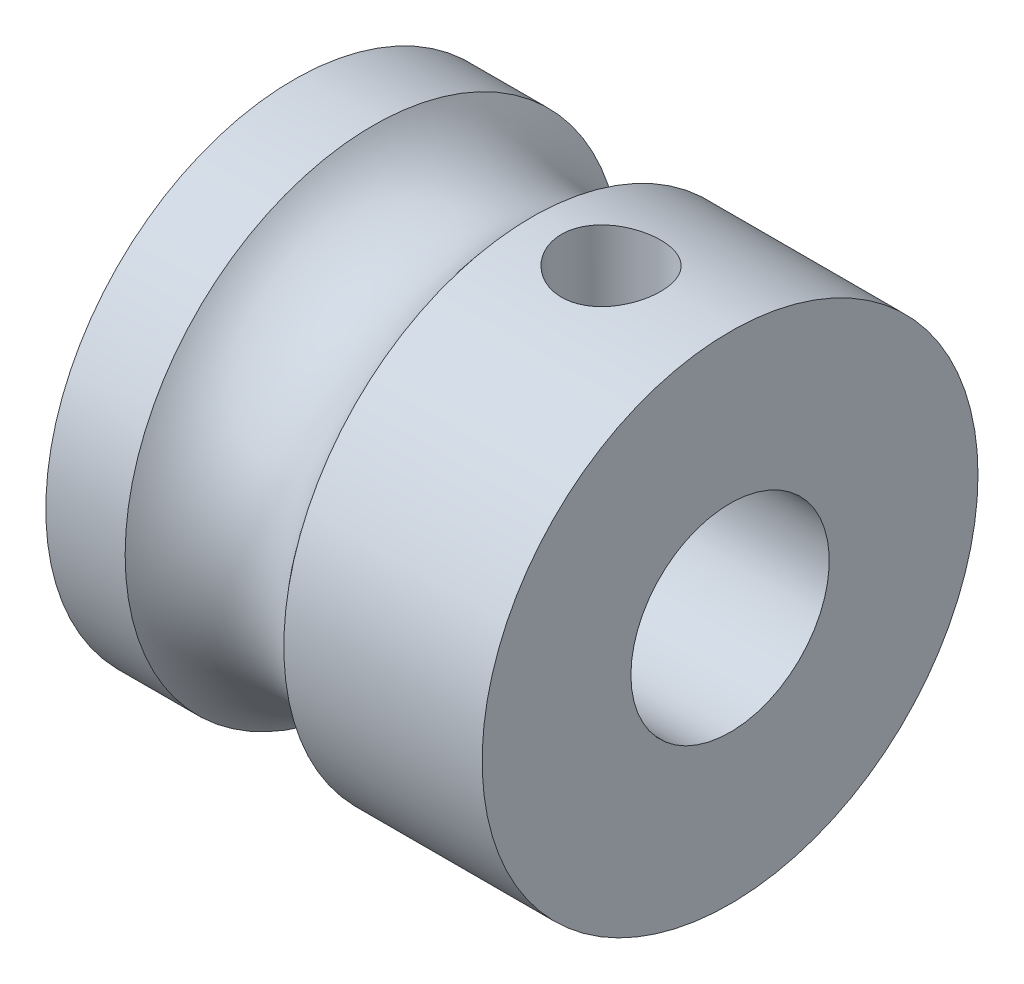
ISO-10303-21;
HEADER;
FILE_DESCRIPTION(('STEP AP214'),'2;1');
FILE_NAME('part.step','',(''),(''),'','','');
FILE_SCHEMA(('AUTOMOTIVE_DESIGN { 1 0 10303 214 1 1 1 1 }'));
ENDSEC;
DATA;
#1=APPLICATION_CONTEXT('core data for automotive mechanical design processes');
#2=APPLICATION_PROTOCOL_DEFINITION('international standard','automotive_design',2000,#1);
#3=PRODUCT_CONTEXT('',#1,'mechanical');
#4=PRODUCT('Part','Part','',(#3));
#5=PRODUCT_RELATED_PRODUCT_CATEGORY('part','',(#4));
#6=PRODUCT_DEFINITION_FORMATION('','',#4);
#7=PRODUCT_DEFINITION_CONTEXT('part definition',#1,'design');
#8=PRODUCT_DEFINITION('design','',#6,#7);
#9=PRODUCT_DEFINITION_SHAPE('','',#8);
#10=(LENGTH_UNIT() NAMED_UNIT(*) SI_UNIT(.MILLI.,.METRE.));
#11=(NAMED_UNIT(*) PLANE_ANGLE_UNIT() SI_UNIT($,.RADIAN.));
#12=(NAMED_UNIT(*) SI_UNIT($,.STERADIAN.) SOLID_ANGLE_UNIT());
#13=UNCERTAINTY_MEASURE_WITH_UNIT(LENGTH_MEASURE(1.E-05),#10,'distance_accuracy_value','');
#14=(GEOMETRIC_REPRESENTATION_CONTEXT(3) GLOBAL_UNCERTAINTY_ASSIGNED_CONTEXT((#13)) GLOBAL_UNIT_ASSIGNED_CONTEXT((#10,
#11,#12)) REPRESENTATION_CONTEXT('',''));
#15=CARTESIAN_POINT('',(0.,0.,0.));
#16=DIRECTION('',(0.,0.,1.));
#17=DIRECTION('',(1.,0.,0.));
#18=AXIS2_PLACEMENT_3D('',#15,#16,#17);
#19=CARTESIAN_POINT('',(-4.2166088223,-11.0652643177,178.13));
#20=DIRECTION('',(-1.,0.,0.));
#21=DIRECTION('',(0.,0.,1.));
#22=AXIS2_PLACEMENT_3D('',#19,#20,#21);
#23=PLANE('',#22);
#24=CARTESIAN_POINT('',(-4.2166088223,-11.0652643177,178.13));
#25=DIRECTION('',(1.,0.,0.));
#26=DIRECTION('',(0.,0.,-1.));
#27=AXIS2_PLACEMENT_3D('',#24,#25,#26);
#28=CIRCLE('',#27,6.25);
#29=CARTESIAN_POINT('',(-4.2166088223,-11.0652643177,171.88));
#30=VERTEX_POINT('',#29);
#31=EDGE_CURVE('E17',#30,#30,#28,.T.);
#32=ORIENTED_EDGE('',*,*,#31,.F.);
#33=EDGE_LOOP('',(#32));
#34=FACE_BOUND('',#33,.T.);
#35=CARTESIAN_POINT('',(-4.2166088223,-11.0652643177,178.13));
#36=DIRECTION('',(-1.,0.,0.));
#37=DIRECTION('',(0.,0.,1.));
#38=AXIS2_PLACEMENT_3D('',#35,#36,#37);
#39=CIRCLE('',#38,2.5);
#40=CARTESIAN_POINT('',(-4.2166088223,-11.0652643177,180.63));
#41=VERTEX_POINT('',#40);
#42=EDGE_CURVE('E82',#41,#41,#39,.F.);
#43=ORIENTED_EDGE('',*,*,#42,.T.);
#44=EDGE_LOOP('',(#43));
#45=FACE_BOUND('',#44,.T.);
#46=ADVANCED_FACE('F14',(#34,#45),#23,.T.);
#47=CARTESIAN_POINT('',(-4.2166088223,-11.0652643177,178.13));
#48=DIRECTION('',(1.,0.,0.));
#49=DIRECTION('',(0.,0.,-1.));
#50=AXIS2_PLACEMENT_3D('',#47,#48,#49);
#51=CYLINDRICAL_SURFACE('',#50,6.25);
#52=CARTESIAN_POINT('',(-2.2166088223,-11.0652643177,178.13));
#53=DIRECTION('',(1.,0.,0.));
#54=DIRECTION('',(0.,0.,1.));
#55=AXIS2_PLACEMENT_3D('',#52,#53,#54);
#56=CIRCLE('',#55,6.24999999999998);
#57=CARTESIAN_POINT('',(-2.2166088223,-11.0652643177,184.38));
#58=VERTEX_POINT('',#57);
#59=EDGE_CURVE('E34',#58,#58,#56,.T.);
#60=ORIENTED_EDGE('',*,*,#59,.F.);
#61=EDGE_LOOP('',(#60));
#62=FACE_BOUND('',#61,.T.);
#63=ORIENTED_EDGE('',*,*,#31,.T.);
#64=EDGE_LOOP('',(#63));
#65=FACE_BOUND('',#64,.T.);
#66=ADVANCED_FACE('F70',(#62,#65),#51,.T.);
#67=CARTESIAN_POINT('',(6.7833911777,-11.0652643177,178.13));
#68=DIRECTION('',(-1.,0.,0.));
#69=DIRECTION('',(0.,0.,1.));
#70=AXIS2_PLACEMENT_3D('',#67,#68,#69);
#71=CYLINDRICAL_SURFACE('',#70,2.5);
#72=CARTESIAN_POINT('',(6.7833911777,-11.0652643177,178.13));
#73=DIRECTION('',(-1.,0.,0.));
#74=DIRECTION('',(0.,0.,1.));
#75=AXIS2_PLACEMENT_3D('',#72,#73,#74);
#76=CIRCLE('',#75,2.5);
#77=CARTESIAN_POINT('',(6.7833911777,-11.0652643177,180.63));
#78=VERTEX_POINT('',#77);
#79=EDGE_CURVE('E60',#78,#78,#76,.F.);
#80=ORIENTED_EDGE('',*,*,#79,.T.);
#81=EDGE_LOOP('',(#80));
#82=FACE_BOUND('',#81,.T.);
#83=CARTESIAN_POINT('',(3.7833911777,-8.9002008082389,176.88));
#84=CARTESIAN_POINT('',(3.71825641745594,-8.90019513359426,176.880004546157));
#85=CARTESIAN_POINT('',(3.65303941329369,-8.89721680285304,176.885125036584));
#86=CARTESIAN_POINT('',(3.52460709685356,-8.88573473704934,176.905345987627));
#87=CARTESIAN_POINT('',(3.46139628389574,-8.87721939200551,176.920467419307));
#88=CARTESIAN_POINT('',(3.33907659727008,-8.85589748513252,176.959875064125));
#89=CARTESIAN_POINT('',(3.27994786210802,-8.84311377428435,176.984112559383));
#90=CARTESIAN_POINT('',(3.16661092520411,-8.81473100748928,177.04091559328));
#91=CARTESIAN_POINT('',(3.11240298987194,-8.79913179924919,177.073481582455));
#92=CARTESIAN_POINT('',(3.00550901700313,-8.76530345448199,177.149166824336));
#93=CARTESIAN_POINT('',(2.95331725810808,-8.74696352222558,177.19293495482));
#94=CARTESIAN_POINT('',(2.85663069219162,-8.71061453287868,177.288432740482));
#95=CARTESIAN_POINT('',(2.8121397244706,-8.69260564480938,177.340166342772));
#96=CARTESIAN_POINT('',(2.72918223876542,-8.65749585578814,177.454388045732));
#97=CARTESIAN_POINT('',(2.69132396787559,-8.64053798747285,177.517366013734));
#98=CARTESIAN_POINT('',(2.6269651111428,-8.61087986645589,177.649803716751));
#99=CARTESIAN_POINT('',(2.60045735752854,-8.59817692790323,177.719259327327));
#100=CARTESIAN_POINT('',(2.56151035107363,-8.57925855214703,177.857443820093));
#101=CARTESIAN_POINT('',(2.54820426975558,-8.57264581493885,177.925872761889));
#102=CARTESIAN_POINT('',(2.5331835293562,-8.56516951962416,178.064286714128));
#103=CARTESIAN_POINT('',(2.53146185670536,-8.56430248289263,178.134270757305));
#104=CARTESIAN_POINT('',(2.53932452016294,-8.56822704374437,178.26729065553));
#105=CARTESIAN_POINT('',(2.54793869710153,-8.572533119048,178.330401498971));
#106=CARTESIAN_POINT('',(2.57449223258082,-8.58558625195316,178.454142214898));
#107=CARTESIAN_POINT('',(2.59243228892028,-8.59433364187008,178.514771901367));
#108=CARTESIAN_POINT('',(2.63724438531227,-8.61561952660432,178.632886739462));
#109=CARTESIAN_POINT('',(2.66423656916509,-8.62820879858501,178.690316779394));
#110=CARTESIAN_POINT('',(2.72622044795187,-8.65604374286641,178.799971001892));
#111=CARTESIAN_POINT('',(2.76121500682794,-8.67129036573145,178.852193311048));
#112=CARTESIAN_POINT('',(2.84201036711627,-8.70470938770964,178.955217076123));
#113=CARTESIAN_POINT('',(2.88851996310752,-8.72302211772281,179.005417593787));
#114=CARTESIAN_POINT('',(2.98912833386273,-8.75958506036486,179.097630462872));
#115=CARTESIAN_POINT('',(3.04323289304259,-8.77783521437964,179.139636514468));
#116=CARTESIAN_POINT('',(3.16170141823012,-8.81346236654395,179.216881668303));
#117=CARTESIAN_POINT('',(3.22649870651778,-8.83071031781616,179.251521643723));
#118=CARTESIAN_POINT('',(3.36206326689876,-8.86057118921781,179.309148891252));
#119=CARTESIAN_POINT('',(3.43282421897196,-8.87318894212416,179.332148322764));
#120=CARTESIAN_POINT('',(3.57240931680349,-8.89095636998707,179.363975263781));
#121=CARTESIAN_POINT('',(3.64094257650444,-8.8966186195938,179.37378140265));
#122=CARTESIAN_POINT('',(3.77889285459567,-8.90129032567988,179.381896183264));
#123=CARTESIAN_POINT('',(3.84830921409973,-8.90030448158361,179.380212946644));
#124=CARTESIAN_POINT('',(3.97795857592341,-8.89233511094269,179.36629505418));
#125=CARTESIAN_POINT('',(4.03836549158491,-8.88601947386682,179.355234770891));
#126=CARTESIAN_POINT('',(4.1563509105387,-8.86908904830824,179.324620355791));
#127=CARTESIAN_POINT('',(4.21392849113326,-8.85847286763708,179.30506347328));
#128=CARTESIAN_POINT('',(4.32765534132836,-8.8335615417043,179.257059485756));
#129=CARTESIAN_POINT('',(4.38361494876693,-8.81911877716171,179.228242579616));
#130=CARTESIAN_POINT('',(4.49022776712374,-8.78831282398438,179.16285883002));
#131=CARTESIAN_POINT('',(4.54087823209161,-8.77194865076065,179.126288005415));
#132=CARTESIAN_POINT('',(4.64211463710444,-8.7366643369958,179.041046458999));
#133=CARTESIAN_POINT('',(4.69188761609708,-8.71768202827139,178.991431590394));
#134=CARTESIAN_POINT('',(4.78265647519199,-8.68108638047635,178.884255619248));
#135=CARTESIAN_POINT('',(4.82364939048817,-8.66347350510364,178.826691843319));
#136=CARTESIAN_POINT('',(4.89660833513762,-8.63099729656304,178.703169203198));
#137=CARTESIAN_POINT('',(4.92830757546363,-8.61621879679964,178.637028871968));
#138=CARTESIAN_POINT('',(4.97981355752174,-8.59172238070874,178.499402955801));
#139=CARTESIAN_POINT('',(4.99963074190788,-8.58200002174534,178.42792212674));
#140=CARTESIAN_POINT('',(5.02510188291832,-8.56942046542647,178.288724602913));
#141=CARTESIAN_POINT('',(5.03188852254514,-8.56601521884761,178.221264304813));
#142=CARTESIAN_POINT('',(5.034445259518,-8.56473768801086,178.086092517561));
#143=CARTESIAN_POINT('',(5.03021921335446,-8.56686346686388,178.018381124631));
#144=CARTESIAN_POINT('',(5.01162066920547,-8.57608970722596,177.889327509604));
#145=CARTESIAN_POINT('',(4.99793511612792,-8.58285313435012,177.827859602736));
#146=CARTESIAN_POINT('',(4.9617324285713,-8.6003631469072,177.708192559771));
#147=CARTESIAN_POINT('',(4.93921402758319,-8.61111030354005,177.649993893806));
#148=CARTESIAN_POINT('',(4.88498236249254,-8.6361901833485,177.535720742194));
#149=CARTESIAN_POINT('',(4.85291702369021,-8.65065660271501,177.479843571625));
#150=CARTESIAN_POINT('',(4.78094376412619,-8.68166265342717,177.374031697732));
#151=CARTESIAN_POINT('',(4.74103224130541,-8.69820323572049,177.324099740731));
#152=CARTESIAN_POINT('',(4.64989475392162,-8.73365668986716,177.226357494804));
#153=CARTESIAN_POINT('',(4.5979380683535,-8.75264183005378,177.179252894326));
#154=CARTESIAN_POINT('',(4.48657777628778,-8.78947586566435,177.094170890757));
#155=CARTESIAN_POINT('',(4.42716765161539,-8.80732374567668,177.056201562487));
#156=CARTESIAN_POINT('',(4.30009536947381,-8.84026925138855,176.989461150268));
#157=CARTESIAN_POINT('',(4.23223176378909,-8.85526213949662,176.961018667549));
#158=CARTESIAN_POINT('',(4.09172567227529,-8.8794373635956,176.916401613117));
#159=CARTESIAN_POINT('',(4.01910006655916,-8.88863911585372,176.900186011031));
#160=CARTESIAN_POINT('',(3.91863448313502,-8.89614841017762,176.887041240169));
#161=CARTESIAN_POINT('',(3.89168130970266,-8.8976627051356,176.884404868795));
#162=CARTESIAN_POINT('',(3.83762057684721,-8.89969011910312,176.880883243638));
#163=CARTESIAN_POINT('',(3.81051300721766,-8.90020317113613,176.879998107));
#164=CARTESIAN_POINT('',(3.7833911777,-8.9002008082389,176.88));
#165=B_SPLINE_CURVE_WITH_KNOTS('',3,(#83,#84,#85,#86,#87,#88,#89,#90,#91,#92,#93,#94,#95,#96,
#97,#98,#99,#100,#101,#102,#103,#104,#105,#106,#107,#108,#109,#110,#111,#112,#113,#114,#115,
#116,#117,#118,#119,#120,#121,#122,#123,#124,#125,#126,#127,#128,#129,#130,#131,#132,#133,#134,
#135,#136,#137,#138,#139,#140,#141,#142,#143,#144,#145,#146,#147,#148,#149,#150,#151,#152,#153,
#154,#155,#156,#157,#158,#159,#160,#161,#162,#163,#164),.UNSPECIFIED.,.T.,.F.,(4,2,2,2,2,2,2,2,
2,2,2,2,2,2,2,2,2,2,2,2,2,2,2,2,2,2,2,2,2,2,2,2,2,2,2,2,2,2,2,2,4),(0.,0.195290153243394,
0.390991116031003,0.585660744898597,0.780340906806432,0.991077890622776,1.20191963855463,
1.42697365298455,1.65188533704863,1.86079356209918,2.0695752960755,2.26020121855673,
2.45084140646819,2.64411918413935,2.83746624187839,3.04908989321114,3.260875603074,
3.48611052161811,3.71110967764631,3.91827863567765,4.12530116485466,4.30967729280032,
4.49411315545079,4.68709120507608,4.88016857775059,5.09758429475768,5.31507331222753,
5.53830226766205,5.76133474760964,5.96390337986854,6.16640108492462,6.35555531089363,
6.54473666890015,6.74200938399339,6.939372876259,7.15637802312586,7.37357428556442,
7.59763436298256,7.82093916253448,7.90225168981635,7.98356965618176),.UNSPECIFIED.);
#166=CARTESIAN_POINT('',(3.7833911777,-8.9002008082389,176.88));
#167=VERTEX_POINT('',#166);
#168=EDGE_CURVE('E55',#167,#167,#165,.T.);
#169=ORIENTED_EDGE('',*,*,#168,.T.);
#170=EDGE_LOOP('',(#169));
#171=FACE_BOUND('',#170,.T.);
#172=ORIENTED_EDGE('',*,*,#42,.F.);
#173=EDGE_LOOP('',(#172));
#174=FACE_BOUND('',#173,.T.);
#175=ADVANCED_FACE('F65',(#82,#171,#174),#71,.F.);
#176=CARTESIAN_POINT('',(6.7833911777,-11.0652643177,178.13));
#177=DIRECTION('',(-1.,0.,0.));
#178=DIRECTION('',(0.,0.,1.));
#179=AXIS2_PLACEMENT_3D('',#176,#177,#178);
#180=PLANE('',#179);
#181=ORIENTED_EDGE('',*,*,#79,.F.);
#182=EDGE_LOOP('',(#181));
#183=FACE_BOUND('',#182,.T.);
#184=CARTESIAN_POINT('',(6.7833911777,-11.0652643177,178.13));
#185=DIRECTION('',(1.,0.,0.));
#186=DIRECTION('',(0.,0.,-1.));
#187=AXIS2_PLACEMENT_3D('',#184,#185,#186);
#188=CIRCLE('',#187,6.25);
#189=CARTESIAN_POINT('',(6.7833911777,-11.0652643177,171.88));
#190=VERTEX_POINT('',#189);
#191=EDGE_CURVE('E26',#190,#190,#188,.F.);
#192=ORIENTED_EDGE('',*,*,#191,.F.);
#193=EDGE_LOOP('',(#192));
#194=FACE_BOUND('',#193,.T.);
#195=ADVANCED_FACE('F69',(#183,#194),#180,.F.);
#196=CARTESIAN_POINT('',(-0.216608822299998,-11.0652643177,178.13));
#197=DIRECTION('',(1.,0.,0.));
#198=DIRECTION('',(0.,0.,1.));
#199=AXIS2_PLACEMENT_3D('',#196,#197,#198);
#200=TOROIDAL_SURFACE('',#199,7.74999999999998,2.5);
#201=ORIENTED_EDGE('',*,*,#59,.T.);
#202=EDGE_LOOP('',(#201));
#203=FACE_BOUND('',#202,.T.);
#204=CARTESIAN_POINT('',(1.7833911777,-11.0652643177,178.13));
#205=DIRECTION('',(1.,0.,0.));
#206=DIRECTION('',(0.,0.,-1.));
#207=AXIS2_PLACEMENT_3D('',#204,#205,#206);
#208=CIRCLE('',#207,6.25);
#209=CARTESIAN_POINT('',(1.7833911777,-11.0652643177,171.88));
#210=VERTEX_POINT('',#209);
#211=EDGE_CURVE('E21',#210,#210,#208,.T.);
#212=ORIENTED_EDGE('',*,*,#211,.F.);
#213=EDGE_LOOP('',(#212));
#214=FACE_BOUND('',#213,.T.);
#215=ADVANCED_FACE('F48',(#203,#214),#200,.F.);
#216=CARTESIAN_POINT('',(3.7833911777,-11.0652643177,178.13));
#217=DIRECTION('',(0.,1.,0.));
#218=DIRECTION('',(-1.,0.,0.));
#219=AXIS2_PLACEMENT_3D('',#216,#217,#218);
#220=CYLINDRICAL_SURFACE('',#219,1.25);
#221=ORIENTED_EDGE('',*,*,#168,.F.);
#222=EDGE_LOOP('',(#221));
#223=FACE_BOUND('',#222,.T.);
#224=CARTESIAN_POINT('',(3.7833911777,-4.94153996074205,176.88));
#225=CARTESIAN_POINT('',(3.85284664705247,-4.94153857965084,176.880002567655));
#226=CARTESIAN_POINT('',(3.92233445683312,-4.94034546336359,176.885808535345));
#227=CARTESIAN_POINT('',(4.05934430909801,-4.93570892538421,176.908859645515));
#228=CARTESIAN_POINT('',(4.12686473348884,-4.93226370312084,176.926113941161));
#229=CARTESIAN_POINT('',(4.25793780690365,-4.92352839644555,176.971505271728));
#230=CARTESIAN_POINT('',(4.32149432961864,-4.91824014750859,176.99963148231));
#231=CARTESIAN_POINT('',(4.44298473356826,-4.90641682411974,177.065938615411));
#232=CARTESIAN_POINT('',(4.50091892837159,-4.89988181926232,177.104118976748));
#233=CARTESIAN_POINT('',(4.61034243251813,-4.8861980715415,177.190026155433));
#234=CARTESIAN_POINT('',(4.66174066255518,-4.87904259473969,177.237867930108));
#235=CARTESIAN_POINT('',(4.75583809467351,-4.86498341391225,177.341491513723));
#236=CARTESIAN_POINT('',(4.79853668697143,-4.85807972756319,177.397273878778));
#237=CARTESIAN_POINT('',(4.87437619973563,-4.8452293624819,177.515798305095));
#238=CARTESIAN_POINT('',(4.90743056997081,-4.839291549681,177.57859679041));
#239=CARTESIAN_POINT('',(4.96248484901016,-4.82911760665422,177.708994812016));
#240=CARTESIAN_POINT('',(4.98448579257623,-4.82488131714841,177.776593898224));
#241=CARTESIAN_POINT('',(5.01652516972453,-4.81863530909487,177.913729033402));
#242=CARTESIAN_POINT('',(5.02671739966376,-4.81659698909844,177.983227825981));
#243=CARTESIAN_POINT('',(5.03532986749789,-4.81487780290493,178.122976789453));
#244=CARTESIAN_POINT('',(5.03375123975728,-4.8151967095405,178.19322688729));
#245=CARTESIAN_POINT('',(5.01898345243055,-4.81813388184356,178.331427500929));
#246=CARTESIAN_POINT('',(5.00595995624018,-4.82071933812702,178.399396517873));
#247=CARTESIAN_POINT('',(4.96893488712638,-4.82786210320739,178.532164533225));
#248=CARTESIAN_POINT('',(4.94493287496016,-4.83241949089951,178.596963404684));
#249=CARTESIAN_POINT('',(4.88647862751592,-4.84304811745052,178.722024329001));
#250=CARTESIAN_POINT('',(4.85196148881889,-4.84912871550971,178.782255217667));
#251=CARTESIAN_POINT('',(4.77350483115424,-4.86213344927768,178.896131307325));
#252=CARTESIAN_POINT('',(4.72956422798685,-4.86905768200972,178.949775749406));
#253=CARTESIAN_POINT('',(4.63259915006441,-4.88312726314425,179.049939288817));
#254=CARTESIAN_POINT('',(4.57942969428801,-4.89027436198105,179.096317895717));
#255=CARTESIAN_POINT('',(4.46599562463656,-4.90386967271549,179.179523116471));
#256=CARTESIAN_POINT('',(4.40573087659601,-4.91031787139315,179.21634954966));
#257=CARTESIAN_POINT('',(4.27961513792275,-4.92178872428845,179.279453518502));
#258=CARTESIAN_POINT('',(4.21375246815043,-4.92680829815563,179.305708309722));
#259=CARTESIAN_POINT('',(4.07842702304501,-4.93480836368409,179.346737927034));
#260=CARTESIAN_POINT('',(4.00896471817615,-4.93778912109465,179.361514249321));
#261=CARTESIAN_POINT('',(3.86968510520119,-4.94132082685215,179.378957507545));
#262=CARTESIAN_POINT('',(3.79989420981207,-4.94191247948557,179.381827323622));
#263=CARTESIAN_POINT('',(3.66083089870039,-4.94070824658933,179.375922035388));
#264=CARTESIAN_POINT('',(3.59155845380142,-4.93891249644515,179.367147591403));
#265=CARTESIAN_POINT('',(3.45618037733471,-4.93317391151357,179.338377760093));
#266=CARTESIAN_POINT('',(3.3900507489053,-4.92925183001879,179.318490776049));
#267=CARTESIAN_POINT('',(3.26206207891408,-4.91972070080419,179.268176294136));
#268=CARTESIAN_POINT('',(3.20020338965535,-4.91411151412163,179.237747927966));
#269=CARTESIAN_POINT('',(3.08162479026229,-4.90174674317451,179.16675517777));
#270=CARTESIAN_POINT('',(3.02498236982396,-4.89497716938871,179.126063847478));
#271=CARTESIAN_POINT('',(2.91925578769885,-4.88109276986704,179.035869465266));
#272=CARTESIAN_POINT('',(2.87017240488843,-4.87397790865227,178.986365506431));
#273=CARTESIAN_POINT('',(2.78018797871802,-4.8600724943348,178.879040341872));
#274=CARTESIAN_POINT('',(2.7394241093875,-4.85328859634145,178.821103123662));
#275=CARTESIAN_POINT('',(2.66820882582552,-4.84092522234225,178.699084870793));
#276=CARTESIAN_POINT('',(2.63775697851902,-4.83534569575986,178.635004094292));
#277=CARTESIAN_POINT('',(2.58823008801671,-4.82604814193666,178.50287835103));
#278=CARTESIAN_POINT('',(2.56909052991718,-4.82231957841745,178.434858341848));
#279=CARTESIAN_POINT('',(2.5425271181202,-4.81709886847925,178.29648681835));
#280=CARTESIAN_POINT('',(2.5351018533554,-4.81560645270196,178.226135585889));
#281=CARTESIAN_POINT('',(2.53223245149639,-4.81503256202349,178.08640888262));
#282=CARTESIAN_POINT('',(2.53658207712973,-4.81590958583311,178.017037734823));
#283=CARTESIAN_POINT('',(2.55668361588477,-4.81988877319603,177.880036210855));
#284=CARTESIAN_POINT('',(2.57243538563509,-4.82299090877061,177.812405812808));
#285=CARTESIAN_POINT('',(2.61480241781456,-4.83107058813749,177.680934062819));
#286=CARTESIAN_POINT('',(2.64139290036399,-4.8360438521011,177.61708444595));
#287=CARTESIAN_POINT('',(2.70465647936363,-4.84733029115772,177.494723474768));
#288=CARTESIAN_POINT('',(2.74133037257965,-4.85364357212653,177.436212542791));
#289=CARTESIAN_POINT('',(2.8244154115276,-4.86704432822664,177.325170137367));
#290=CARTESIAN_POINT('',(2.87097409818347,-4.87414264992322,177.272750354854));
#291=CARTESIAN_POINT('',(2.97220397781972,-4.88824903140472,177.176396727804));
#292=CARTESIAN_POINT('',(3.02687708953592,-4.89525706941406,177.132464895997));
#293=CARTESIAN_POINT('',(3.14349032357522,-4.90847253332545,177.053884725681));
#294=CARTESIAN_POINT('',(3.20550237915046,-4.9146705223084,177.0193414817));
#295=CARTESIAN_POINT('',(3.33455714432462,-4.92544885289444,176.96121993839));
#296=CARTESIAN_POINT('',(3.4015952260724,-4.93003066098804,176.937631692526));
#297=CARTESIAN_POINT('',(3.52121924699572,-4.93614330358848,176.906663575182));
#298=CARTESIAN_POINT('',(3.57312295208932,-4.93815450625424,176.896682626846));
#299=CARTESIAN_POINT('',(3.67780862089205,-4.94085333697463,176.883349977549));
#300=CARTESIAN_POINT('',(3.73059055426022,-4.94154101065904,176.879998048047));
#301=CARTESIAN_POINT('',(3.7833911777,-4.94153996074205,176.88));
#302=B_SPLINE_CURVE_WITH_KNOTS('',3,(#224,#225,#226,#227,#228,#229,#230,#231,#232,#233,#234,
#235,#236,#237,#238,#239,#240,#241,#242,#243,#244,#245,#246,#247,#248,#249,#250,#251,#252,#253,
#254,#255,#256,#257,#258,#259,#260,#261,#262,#263,#264,#265,#266,#267,#268,#269,#270,#271,#272,
#273,#274,#275,#276,#277,#278,#279,#280,#281,#282,#283,#284,#285,#286,#287,#288,#289,#290,#291,
#292,#293,#294,#295,#296,#297,#298,#299,#300,#301),.UNSPECIFIED.,.T.,.F.,(4,2,2,2,2,2,2,2,2,2,2,
2,2,2,2,2,2,2,2,2,2,2,2,2,2,2,2,2,2,2,2,2,2,2,2,2,2,2,4),(0.,0.208173079820661,
0.416512799074081,0.62464562239442,0.832766831043532,1.04352815682417,1.25430425041149,
1.46691750543683,1.67951085305072,1.88930311100722,2.09907515142185,2.30585987038792,
2.51265286339058,2.7207490527475,2.92886919709452,3.14061683449975,3.3523684765027,
3.56457328962841,3.77675043766902,3.98529697252613,4.19383168157398,4.40036677226018,
4.60691887939869,4.81616324715024,5.02542916084633,5.23790752163683,5.450376957845,
5.66162266970185,5.87284293361404,6.08038771765231,6.28792989205316,6.49500021341187,
6.70208690165228,6.91251440028867,7.12299173609097,7.33573623220673,7.54828718858038,
7.70654754542991,7.86480244602139),.UNSPECIFIED.);
#303=CARTESIAN_POINT('',(3.7833911777,-4.94153996074205,176.88));
#304=VERTEX_POINT('',#303);
#305=EDGE_CURVE('E10',#304,#304,#302,.T.);
#306=ORIENTED_EDGE('',*,*,#305,.F.);
#307=EDGE_LOOP('',(#306));
#308=FACE_BOUND('',#307,.T.);
#309=ADVANCED_FACE('F37',(#223,#308),#220,.F.);
#310=CARTESIAN_POINT('',(1.7833911777,-11.0652643177,178.13));
#311=DIRECTION('',(1.,0.,0.));
#312=DIRECTION('',(0.,0.,-1.));
#313=AXIS2_PLACEMENT_3D('',#310,#311,#312);
#314=CYLINDRICAL_SURFACE('',#313,6.25);
#315=ORIENTED_EDGE('',*,*,#211,.T.);
#316=EDGE_LOOP('',(#315));
#317=FACE_BOUND('',#316,.T.);
#318=ORIENTED_EDGE('',*,*,#305,.T.);
#319=EDGE_LOOP('',(#318));
#320=FACE_BOUND('',#319,.T.);
#321=ORIENTED_EDGE('',*,*,#191,.T.);
#322=EDGE_LOOP('',(#321));
#323=FACE_BOUND('',#322,.T.);
#324=ADVANCED_FACE('F40',(#317,#320,#323),#314,.T.);
#325=CLOSED_SHELL('',(#46,#66,#175,#195,#215,#309,#324));
#326=MANIFOLD_SOLID_BREP('B1',#325);
#327=ADVANCED_BREP_SHAPE_REPRESENTATION('',(#18,#326),#14);
#328=SHAPE_DEFINITION_REPRESENTATION(#9,#327);
ENDSEC;
END-ISO-10303-21;
